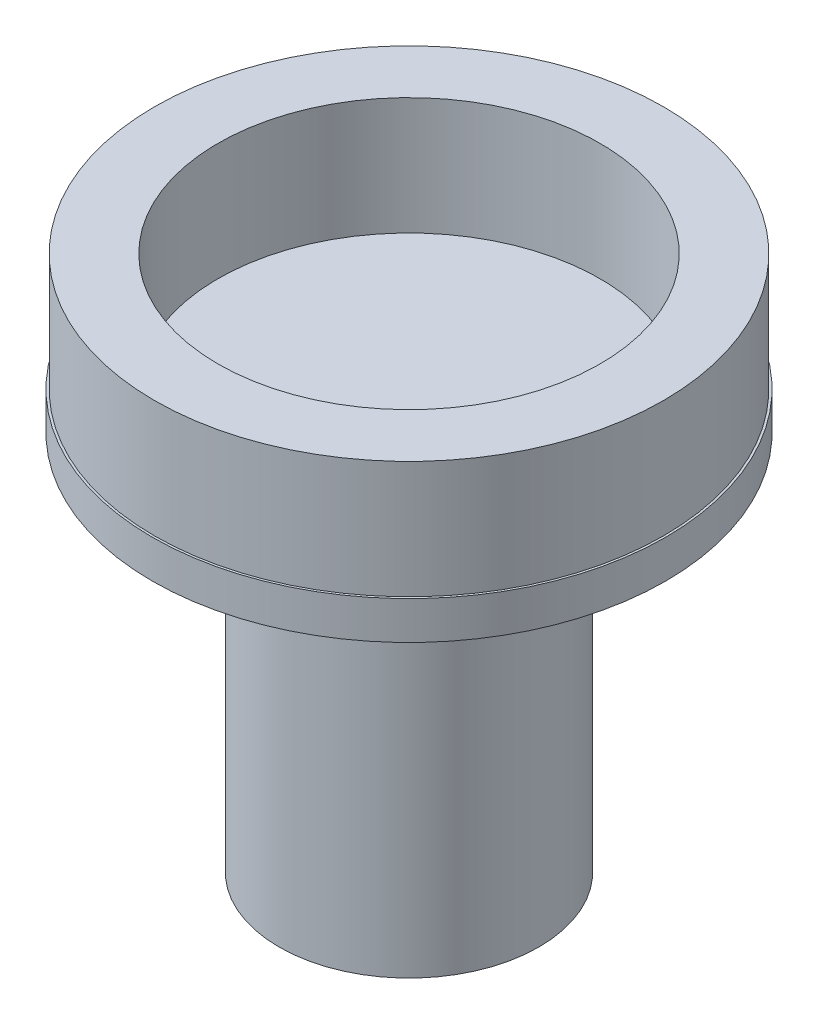
ISO-10303-21;
HEADER;
FILE_DESCRIPTION(('STEP AP214'),'2;1');
FILE_NAME('part.step','',(''),(''),'','','');
FILE_SCHEMA(('AUTOMOTIVE_DESIGN { 1 0 10303 214 1 1 1 1 }'));
ENDSEC;
DATA;
#1=APPLICATION_CONTEXT('core data for automotive mechanical design processes');
#2=APPLICATION_PROTOCOL_DEFINITION('international standard','automotive_design',2000,#1);
#3=PRODUCT_CONTEXT('',#1,'mechanical');
#4=PRODUCT('Part','Part','',(#3));
#5=PRODUCT_RELATED_PRODUCT_CATEGORY('part','',(#4));
#6=PRODUCT_DEFINITION_FORMATION('','',#4);
#7=PRODUCT_DEFINITION_CONTEXT('part definition',#1,'design');
#8=PRODUCT_DEFINITION('design','',#6,#7);
#9=PRODUCT_DEFINITION_SHAPE('','',#8);
#10=(LENGTH_UNIT() NAMED_UNIT(*) SI_UNIT(.MILLI.,.METRE.));
#11=(NAMED_UNIT(*) PLANE_ANGLE_UNIT() SI_UNIT($,.RADIAN.));
#12=(NAMED_UNIT(*) SI_UNIT($,.STERADIAN.) SOLID_ANGLE_UNIT());
#13=UNCERTAINTY_MEASURE_WITH_UNIT(LENGTH_MEASURE(1.E-05),#10,'distance_accuracy_value','');
#14=(GEOMETRIC_REPRESENTATION_CONTEXT(3) GLOBAL_UNCERTAINTY_ASSIGNED_CONTEXT((#13)) GLOBAL_UNIT_ASSIGNED_CONTEXT((#10,
#11,#12)) REPRESENTATION_CONTEXT('',''));
#15=CARTESIAN_POINT('',(0.,0.,0.));
#16=DIRECTION('',(0.,0.,1.));
#17=DIRECTION('',(1.,0.,0.));
#18=AXIS2_PLACEMENT_3D('',#15,#16,#17);
#19=CARTESIAN_POINT('',(0.,1.85,0.));
#20=DIRECTION('',(0.,1.,0.));
#21=DIRECTION('',(0.,0.,1.));
#22=AXIS2_PLACEMENT_3D('',#19,#20,#21);
#23=PLANE('',#22);
#24=CARTESIAN_POINT('',(0.,1.85,0.));
#25=DIRECTION('',(0.,1.,0.));
#26=DIRECTION('',(0.,0.,1.));
#27=AXIS2_PLACEMENT_3D('',#24,#25,#26);
#28=CIRCLE('',#27,4.015);
#29=CARTESIAN_POINT('',(0.,1.85,4.015));
#30=VERTEX_POINT('',#29);
#31=EDGE_CURVE('E42',#30,#30,#28,.T.);
#32=ORIENTED_EDGE('',*,*,#31,.T.);
#33=EDGE_LOOP('',(#32));
#34=FACE_BOUND('',#33,.T.);
#35=CARTESIAN_POINT('',(0.,1.85,0.));
#36=DIRECTION('',(0.,1.,0.));
#37=DIRECTION('',(0.,0.,1.));
#38=AXIS2_PLACEMENT_3D('',#35,#36,#37);
#39=CIRCLE('',#38,3.015);
#40=CARTESIAN_POINT('',(0.,1.85,3.015));
#41=VERTEX_POINT('',#40);
#42=EDGE_CURVE('E46',#41,#41,#39,.T.);
#43=ORIENTED_EDGE('',*,*,#42,.F.);
#44=EDGE_LOOP('',(#43));
#45=FACE_BOUND('',#44,.T.);
#46=ADVANCED_FACE('F35',(#34,#45),#23,.T.);
#47=CARTESIAN_POINT('',(0.,1.85,0.));
#48=DIRECTION('',(0.,-1.,0.));
#49=DIRECTION('',(0.,0.,-1.));
#50=AXIS2_PLACEMENT_3D('',#47,#48,#49);
#51=CYLINDRICAL_SURFACE('',#50,4.015);
#52=ORIENTED_EDGE('',*,*,#31,.F.);
#53=EDGE_LOOP('',(#52));
#54=FACE_BOUND('',#53,.T.);
#55=CARTESIAN_POINT('',(0.,0.,0.));
#56=DIRECTION('',(0.,1.,0.));
#57=DIRECTION('',(0.,0.,1.));
#58=AXIS2_PLACEMENT_3D('',#55,#56,#57);
#59=CIRCLE('',#58,4.015);
#60=CARTESIAN_POINT('',(0.,0.,4.015));
#61=VERTEX_POINT('',#60);
#62=EDGE_CURVE('E54',#61,#61,#59,.T.);
#63=ORIENTED_EDGE('',*,*,#62,.T.);
#64=EDGE_LOOP('',(#63));
#65=FACE_BOUND('',#64,.T.);
#66=ADVANCED_FACE('F37',(#54,#65),#51,.T.);
#67=CARTESIAN_POINT('',(0.,1.85,0.));
#68=DIRECTION('',(0.,-1.,0.));
#69=DIRECTION('',(0.,0.,-1.));
#70=AXIS2_PLACEMENT_3D('',#67,#68,#69);
#71=CYLINDRICAL_SURFACE('',#70,3.015);
#72=ORIENTED_EDGE('',*,*,#42,.T.);
#73=EDGE_LOOP('',(#72));
#74=FACE_BOUND('',#73,.T.);
#75=CARTESIAN_POINT('',(0.,0.,0.));
#76=DIRECTION('',(0.,1.,0.));
#77=DIRECTION('',(0.,0.,1.));
#78=AXIS2_PLACEMENT_3D('',#75,#76,#77);
#79=CIRCLE('',#78,3.015);
#80=CARTESIAN_POINT('',(0.,0.,3.015));
#81=VERTEX_POINT('',#80);
#82=EDGE_CURVE('E50',#81,#81,#79,.T.);
#83=ORIENTED_EDGE('',*,*,#82,.F.);
#84=EDGE_LOOP('',(#83));
#85=FACE_BOUND('',#84,.T.);
#86=ADVANCED_FACE('F98',(#74,#85),#71,.F.);
#87=CARTESIAN_POINT('',(0.,0.,0.));
#88=DIRECTION('',(0.,1.,0.));
#89=DIRECTION('',(0.,0.,1.));
#90=AXIS2_PLACEMENT_3D('',#87,#88,#89);
#91=PLANE('',#90);
#92=ORIENTED_EDGE('',*,*,#82,.T.);
#93=EDGE_LOOP('',(#92));
#94=FACE_BOUND('',#93,.T.);
#95=ADVANCED_FACE('F92',(#94),#91,.T.);
#96=CARTESIAN_POINT('',(0.,-0.6,0.));
#97=DIRECTION('',(0.,1.,0.));
#98=DIRECTION('',(0.,0.,1.));
#99=AXIS2_PLACEMENT_3D('',#96,#97,#98);
#100=CYLINDRICAL_SURFACE('',#99,4.05);
#101=CARTESIAN_POINT('',(0.,-0.6,0.));
#102=DIRECTION('',(0.,1.,0.));
#103=DIRECTION('',(0.,0.,1.));
#104=AXIS2_PLACEMENT_3D('',#101,#102,#103);
#105=CIRCLE('',#104,4.05);
#106=CARTESIAN_POINT('',(0.,-0.6,4.05));
#107=VERTEX_POINT('',#106);
#108=EDGE_CURVE('E58',#107,#107,#105,.T.);
#109=ORIENTED_EDGE('',*,*,#108,.T.);
#110=EDGE_LOOP('',(#109));
#111=FACE_BOUND('',#110,.T.);
#112=CARTESIAN_POINT('',(0.,0.,0.));
#113=DIRECTION('',(0.,1.,0.));
#114=DIRECTION('',(0.,0.,1.));
#115=AXIS2_PLACEMENT_3D('',#112,#113,#114);
#116=CIRCLE('',#115,4.05);
#117=CARTESIAN_POINT('',(0.,0.,4.05));
#118=VERTEX_POINT('',#117);
#119=EDGE_CURVE('E59',#118,#118,#116,.T.);
#120=ORIENTED_EDGE('',*,*,#119,.F.);
#121=EDGE_LOOP('',(#120));
#122=FACE_BOUND('',#121,.T.);
#123=ADVANCED_FACE('F105',(#111,#122),#100,.T.);
#124=CARTESIAN_POINT('',(0.,-0.6,0.));
#125=DIRECTION('',(0.,1.,0.));
#126=DIRECTION('',(0.,0.,1.));
#127=AXIS2_PLACEMENT_3D('',#124,#125,#126);
#128=PLANE('',#127);
#129=CARTESIAN_POINT('',(0.,-0.6,0.));
#130=DIRECTION('',(0.,1.,0.));
#131=DIRECTION('',(0.,0.,1.));
#132=AXIS2_PLACEMENT_3D('',#129,#130,#131);
#133=CIRCLE('',#132,2.05);
#134=CARTESIAN_POINT('',(0.,-0.6,2.05));
#135=VERTEX_POINT('',#134);
#136=EDGE_CURVE('E10',#135,#135,#133,.F.);
#137=ORIENTED_EDGE('',*,*,#136,.F.);
#138=EDGE_LOOP('',(#137));
#139=FACE_BOUND('',#138,.T.);
#140=ORIENTED_EDGE('',*,*,#108,.F.);
#141=EDGE_LOOP('',(#140));
#142=FACE_BOUND('',#141,.T.);
#143=ADVANCED_FACE('F89',(#139,#142),#128,.F.);
#144=ORIENTED_EDGE('',*,*,#62,.F.);
#145=EDGE_LOOP('',(#144));
#146=FACE_BOUND('',#145,.T.);
#147=ORIENTED_EDGE('',*,*,#119,.T.);
#148=EDGE_LOOP('',(#147));
#149=FACE_BOUND('',#148,.T.);
#150=ADVANCED_FACE('F80',(#146,#149),#91,.T.);
#151=CARTESIAN_POINT('',(0.,-6.6,0.));
#152=DIRECTION('',(0.,-1.,0.));
#153=DIRECTION('',(0.,0.,-1.));
#154=AXIS2_PLACEMENT_3D('',#151,#152,#153);
#155=PLANE('',#154);
#156=CARTESIAN_POINT('',(0.,-6.6,0.));
#157=DIRECTION('',(0.,-1.,0.));
#158=DIRECTION('',(0.,0.,-1.));
#159=AXIS2_PLACEMENT_3D('',#156,#157,#158);
#160=CIRCLE('',#159,2.05);
#161=CARTESIAN_POINT('',(0.,-6.6,-2.05));
#162=VERTEX_POINT('',#161);
#163=EDGE_CURVE('E62',#162,#162,#160,.T.);
#164=ORIENTED_EDGE('',*,*,#163,.T.);
#165=EDGE_LOOP('',(#164));
#166=FACE_BOUND('',#165,.T.);
#167=CARTESIAN_POINT('',(0.,-6.6,0.));
#168=DIRECTION('',(0.,-1.,0.));
#169=DIRECTION('',(0.,0.,-1.));
#170=AXIS2_PLACEMENT_3D('',#167,#168,#169);
#171=CIRCLE('',#170,1.05);
#172=CARTESIAN_POINT('',(0.,-6.6,-1.05));
#173=VERTEX_POINT('',#172);
#174=EDGE_CURVE('E67',#173,#173,#171,.T.);
#175=ORIENTED_EDGE('',*,*,#174,.F.);
#176=EDGE_LOOP('',(#175));
#177=FACE_BOUND('',#176,.T.);
#178=ADVANCED_FACE('F77',(#166,#177),#155,.T.);
#179=CARTESIAN_POINT('',(0.,-6.6,0.));
#180=DIRECTION('',(0.,1.,0.));
#181=DIRECTION('',(0.,0.,1.));
#182=AXIS2_PLACEMENT_3D('',#179,#180,#181);
#183=CYLINDRICAL_SURFACE('',#182,2.05);
#184=ORIENTED_EDGE('',*,*,#163,.F.);
#185=EDGE_LOOP('',(#184));
#186=FACE_BOUND('',#185,.T.);
#187=ORIENTED_EDGE('',*,*,#136,.T.);
#188=EDGE_LOOP('',(#187));
#189=FACE_BOUND('',#188,.T.);
#190=ADVANCED_FACE('F79',(#186,#189),#183,.T.);
#191=CARTESIAN_POINT('',(0.,-6.6,0.));
#192=DIRECTION('',(0.,1.,0.));
#193=DIRECTION('',(0.,0.,1.));
#194=AXIS2_PLACEMENT_3D('',#191,#192,#193);
#195=CYLINDRICAL_SURFACE('',#194,1.05);
#196=ORIENTED_EDGE('',*,*,#174,.T.);
#197=EDGE_LOOP('',(#196));
#198=FACE_BOUND('',#197,.T.);
#199=CARTESIAN_POINT('',(0.,-0.6,0.));
#200=DIRECTION('',(0.,-1.,0.));
#201=DIRECTION('',(0.,0.,-1.));
#202=AXIS2_PLACEMENT_3D('',#199,#200,#201);
#203=CIRCLE('',#202,1.05);
#204=CARTESIAN_POINT('',(0.,-0.6,-1.05));
#205=VERTEX_POINT('',#204);
#206=EDGE_CURVE('E68',#205,#205,#203,.T.);
#207=ORIENTED_EDGE('',*,*,#206,.F.);
#208=EDGE_LOOP('',(#207));
#209=FACE_BOUND('',#208,.T.);
#210=ADVANCED_FACE('F74',(#198,#209),#195,.F.);
#211=ORIENTED_EDGE('',*,*,#206,.T.);
#212=EDGE_LOOP('',(#211));
#213=FACE_BOUND('',#212,.T.);
#214=ADVANCED_FACE('F111',(#213),#128,.F.);
#215=CLOSED_SHELL('',(#46,#66,#86,#95,#123,#143,#150,#178,#190,#210,#214));
#216=MANIFOLD_SOLID_BREP('B2',#215);
#217=ADVANCED_BREP_SHAPE_REPRESENTATION('',(#18,#216),#14);
#218=SHAPE_DEFINITION_REPRESENTATION(#9,#217);
ENDSEC;
END-ISO-10303-21;
